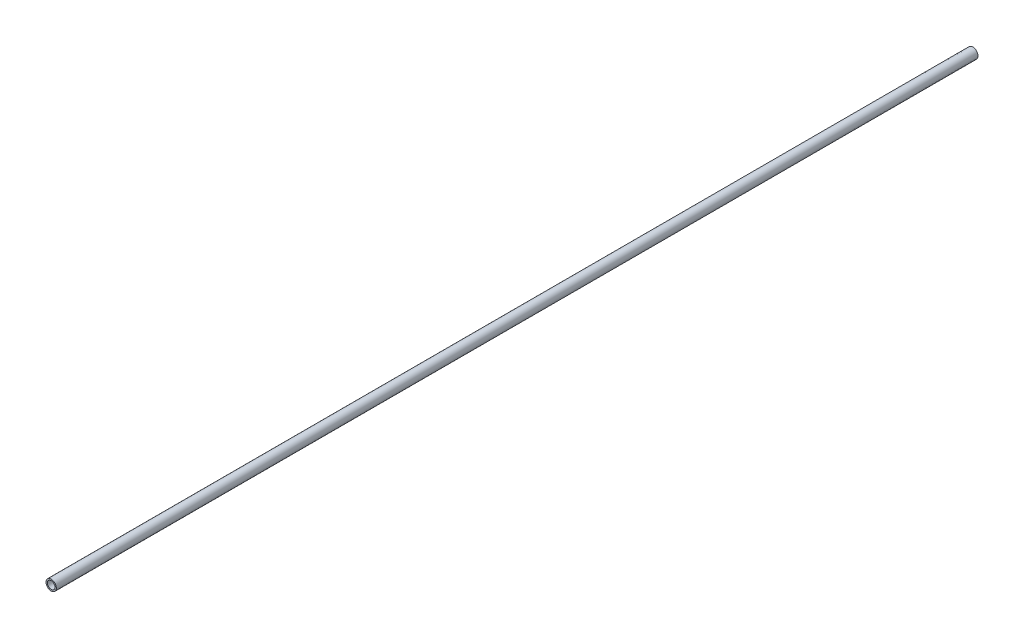
ISO-10303-21;
HEADER;
FILE_DESCRIPTION(('STEP AP214'),'2;1');
FILE_NAME('part.step','',(''),(''),'','','');
FILE_SCHEMA(('AUTOMOTIVE_DESIGN { 1 0 10303 214 1 1 1 1 }'));
ENDSEC;
DATA;
#1=APPLICATION_CONTEXT('core data for automotive mechanical design processes');
#2=APPLICATION_PROTOCOL_DEFINITION('international standard','automotive_design',2000,#1);
#3=PRODUCT_CONTEXT('',#1,'mechanical');
#4=PRODUCT('Part','Part','',(#3));
#5=PRODUCT_RELATED_PRODUCT_CATEGORY('part','',(#4));
#6=PRODUCT_DEFINITION_FORMATION('','',#4);
#7=PRODUCT_DEFINITION_CONTEXT('part definition',#1,'design');
#8=PRODUCT_DEFINITION('design','',#6,#7);
#9=PRODUCT_DEFINITION_SHAPE('','',#8);
#10=(LENGTH_UNIT() NAMED_UNIT(*) SI_UNIT(.MILLI.,.METRE.));
#11=(NAMED_UNIT(*) PLANE_ANGLE_UNIT() SI_UNIT($,.RADIAN.));
#12=(NAMED_UNIT(*) SI_UNIT($,.STERADIAN.) SOLID_ANGLE_UNIT());
#13=UNCERTAINTY_MEASURE_WITH_UNIT(LENGTH_MEASURE(1.E-05),#10,'distance_accuracy_value','');
#14=(GEOMETRIC_REPRESENTATION_CONTEXT(3) GLOBAL_UNCERTAINTY_ASSIGNED_CONTEXT((#13)) GLOBAL_UNIT_ASSIGNED_CONTEXT((#10,
#11,#12)) REPRESENTATION_CONTEXT('',''));
#15=CARTESIAN_POINT('',(0.,0.,0.));
#16=DIRECTION('',(0.,0.,1.));
#17=DIRECTION('',(1.,0.,0.));
#18=AXIS2_PLACEMENT_3D('',#15,#16,#17);
#19=CARTESIAN_POINT('',(0.,0.,762.));
#20=DIRECTION('',(0.,0.,1.));
#21=DIRECTION('',(1.,0.,0.));
#22=AXIS2_PLACEMENT_3D('',#19,#20,#21);
#23=PLANE('',#22);
#24=CARTESIAN_POINT('',(0.,0.,762.));
#25=DIRECTION('',(0.,0.,1.));
#26=DIRECTION('',(1.,0.,0.));
#27=AXIS2_PLACEMENT_3D('',#24,#25,#26);
#28=CIRCLE('',#27,8.5725);
#29=CARTESIAN_POINT('',(8.5725,0.,762.));
#30=VERTEX_POINT('',#29);
#31=EDGE_CURVE('E11',#30,#30,#28,.T.);
#32=ORIENTED_EDGE('',*,*,#31,.T.);
#33=EDGE_LOOP('',(#32));
#34=FACE_BOUND('',#33,.T.);
#35=CARTESIAN_POINT('',(0.,0.,762.));
#36=DIRECTION('',(0.,0.,1.));
#37=DIRECTION('',(1.,0.,0.));
#38=AXIS2_PLACEMENT_3D('',#35,#36,#37);
#39=CIRCLE('',#38,6.2611);
#40=CARTESIAN_POINT('',(6.2611,0.,762.));
#41=VERTEX_POINT('',#40);
#42=EDGE_CURVE('E48',#41,#41,#39,.T.);
#43=ORIENTED_EDGE('',*,*,#42,.F.);
#44=EDGE_LOOP('',(#43));
#45=FACE_BOUND('',#44,.T.);
#46=ADVANCED_FACE('F37',(#34,#45),#23,.T.);
#47=CARTESIAN_POINT('',(0.,0.,-762.));
#48=DIRECTION('',(0.,0.,1.));
#49=DIRECTION('',(1.,0.,0.));
#50=AXIS2_PLACEMENT_3D('',#47,#48,#49);
#51=PLANE('',#50);
#52=CARTESIAN_POINT('',(0.,0.,-762.));
#53=DIRECTION('',(0.,0.,1.));
#54=DIRECTION('',(1.,0.,0.));
#55=AXIS2_PLACEMENT_3D('',#52,#53,#54);
#56=CIRCLE('',#55,8.5725);
#57=CARTESIAN_POINT('',(8.5725,0.,-762.));
#58=VERTEX_POINT('',#57);
#59=EDGE_CURVE('E41',#58,#58,#56,.T.);
#60=ORIENTED_EDGE('',*,*,#59,.F.);
#61=EDGE_LOOP('',(#60));
#62=FACE_BOUND('',#61,.T.);
#63=CARTESIAN_POINT('',(0.,0.,-762.));
#64=DIRECTION('',(0.,0.,1.));
#65=DIRECTION('',(1.,0.,0.));
#66=AXIS2_PLACEMENT_3D('',#63,#64,#65);
#67=CIRCLE('',#66,6.2611);
#68=CARTESIAN_POINT('',(6.2611,0.,-762.));
#69=VERTEX_POINT('',#68);
#70=EDGE_CURVE('E50',#69,#69,#67,.T.);
#71=ORIENTED_EDGE('',*,*,#70,.T.);
#72=EDGE_LOOP('',(#71));
#73=FACE_BOUND('',#72,.T.);
#74=ADVANCED_FACE('F60',(#62,#73),#51,.F.);
#75=CARTESIAN_POINT('',(0.,0.,762.));
#76=DIRECTION('',(0.,0.,-1.));
#77=DIRECTION('',(-1.,0.,0.));
#78=AXIS2_PLACEMENT_3D('',#75,#76,#77);
#79=CYLINDRICAL_SURFACE('',#78,8.5725);
#80=ORIENTED_EDGE('',*,*,#31,.F.);
#81=EDGE_LOOP('',(#80));
#82=FACE_BOUND('',#81,.T.);
#83=ORIENTED_EDGE('',*,*,#59,.T.);
#84=EDGE_LOOP('',(#83));
#85=FACE_BOUND('',#84,.T.);
#86=ADVANCED_FACE('F39',(#82,#85),#79,.T.);
#87=CARTESIAN_POINT('',(0.,0.,762.));
#88=DIRECTION('',(0.,0.,-1.));
#89=DIRECTION('',(-1.,0.,0.));
#90=AXIS2_PLACEMENT_3D('',#87,#88,#89);
#91=CYLINDRICAL_SURFACE('',#90,6.2611);
#92=ORIENTED_EDGE('',*,*,#42,.T.);
#93=EDGE_LOOP('',(#92));
#94=FACE_BOUND('',#93,.T.);
#95=ORIENTED_EDGE('',*,*,#70,.F.);
#96=EDGE_LOOP('',(#95));
#97=FACE_BOUND('',#96,.T.);
#98=ADVANCED_FACE('F56',(#94,#97),#91,.F.);
#99=CLOSED_SHELL('',(#46,#74,#86,#98));
#100=MANIFOLD_SOLID_BREP('B2',#99);
#101=ADVANCED_BREP_SHAPE_REPRESENTATION('',(#18,#100),#14);
#102=SHAPE_DEFINITION_REPRESENTATION(#9,#101);
ENDSEC;
END-ISO-10303-21;
